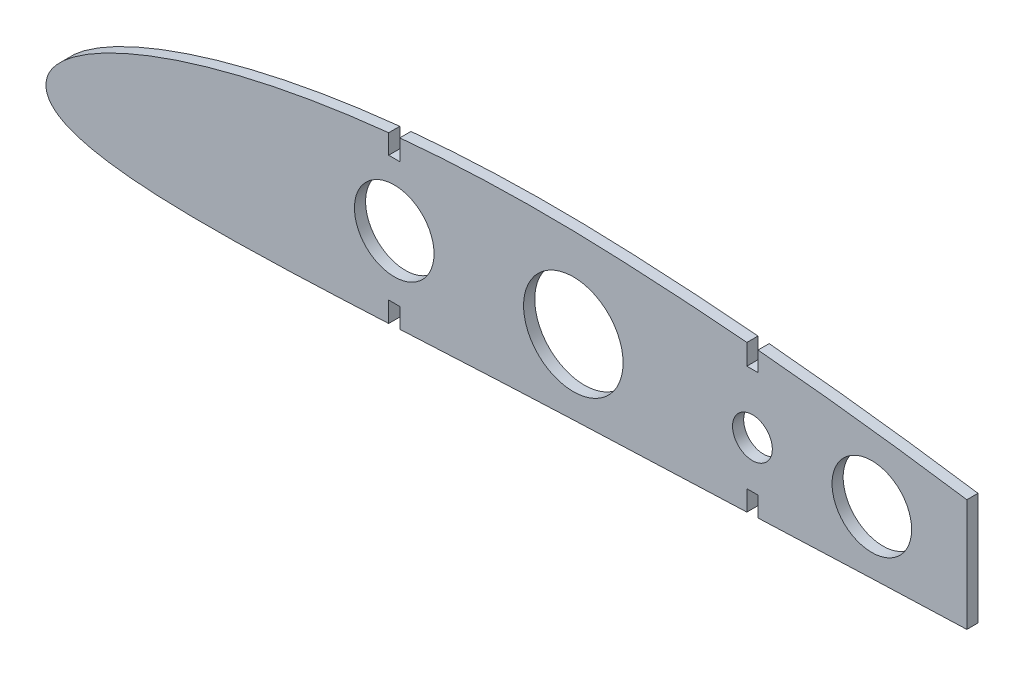
ISO-10303-21;
HEADER;
FILE_DESCRIPTION(('STEP AP214'),'2;1');
FILE_NAME('part.step','',(''),(''),'','','');
FILE_SCHEMA(('AUTOMOTIVE_DESIGN { 1 0 10303 214 1 1 1 1 }'));
ENDSEC;
DATA;
#1=APPLICATION_CONTEXT('core data for automotive mechanical design processes');
#2=APPLICATION_PROTOCOL_DEFINITION('international standard','automotive_design',2000,#1);
#3=PRODUCT_CONTEXT('',#1,'mechanical');
#4=PRODUCT('Part','Part','',(#3));
#5=PRODUCT_RELATED_PRODUCT_CATEGORY('part','',(#4));
#6=PRODUCT_DEFINITION_FORMATION('','',#4);
#7=PRODUCT_DEFINITION_CONTEXT('part definition',#1,'design');
#8=PRODUCT_DEFINITION('design','',#6,#7);
#9=PRODUCT_DEFINITION_SHAPE('','',#8);
#10=(LENGTH_UNIT() NAMED_UNIT(*) SI_UNIT(.MILLI.,.METRE.));
#11=(NAMED_UNIT(*) PLANE_ANGLE_UNIT() SI_UNIT($,.RADIAN.));
#12=(NAMED_UNIT(*) SI_UNIT($,.STERADIAN.) SOLID_ANGLE_UNIT());
#13=UNCERTAINTY_MEASURE_WITH_UNIT(LENGTH_MEASURE(1.E-05),#10,'distance_accuracy_value','');
#14=(GEOMETRIC_REPRESENTATION_CONTEXT(3) GLOBAL_UNCERTAINTY_ASSIGNED_CONTEXT((#13)) GLOBAL_UNIT_ASSIGNED_CONTEXT((#10,
#11,#12)) REPRESENTATION_CONTEXT('',''));
#15=CARTESIAN_POINT('',(0.,0.,0.));
#16=DIRECTION('',(0.,0.,1.));
#17=DIRECTION('',(1.,0.,0.));
#18=AXIS2_PLACEMENT_3D('',#15,#16,#17);
#19=CARTESIAN_POINT('',(39.6973889370821,23.944414653697,1.4));
#20=DIRECTION('',(0.,0.,-1.));
#21=DIRECTION('',(-1.,0.,0.));
#22=AXIS2_PLACEMENT_3D('',#19,#20,#21);
#23=PLANE('',#22);
#24=CARTESIAN_POINT('',(86.1,32.6822836326879,1.4));
#25=CARTESIAN_POINT('',(84.2510346578938,32.4889993263906,1.4));
#26=CARTESIAN_POINT('',(79.618112888192,31.9650030765368,1.4));
#27=CARTESIAN_POINT('',(72.2480677637087,30.9666917302447,1.4));
#28=CARTESIAN_POINT('',(64.0421604360207,29.6191902049138,1.4));
#29=CARTESIAN_POINT('',(55.9942006318401,28.0495199453062,1.4));
#30=CARTESIAN_POINT('',(48.1570877793211,26.2588427278324,1.4));
#31=CARTESIAN_POINT('',(40.6145349449317,24.258661850582,1.4));
#32=CARTESIAN_POINT('',(33.4961177715494,22.0806108900788,1.4));
#33=CARTESIAN_POINT('',(26.978950375824,19.7879772075339,1.4));
#34=CARTESIAN_POINT('',(21.2507377478071,17.4766696125604,1.4));
#35=CARTESIAN_POINT('',(16.4366661061337,15.2538553927234,1.4));
#36=CARTESIAN_POINT('',(12.5431206165653,13.2014083114473,1.4));
#37=CARTESIAN_POINT('',(9.46524765214313,11.3520444791679,1.4));
#38=CARTESIAN_POINT('',(7.04719364729386,9.69449327665322,1.4));
#39=CARTESIAN_POINT('',(5.14037290680512,8.19592153004412,1.4));
#40=CARTESIAN_POINT('',(3.62894157247065,6.81982751608439,1.4));
#41=CARTESIAN_POINT('',(2.4334459359028,5.5336340406067,1.4));
#42=CARTESIAN_POINT('',(1.49781916174154,4.31332492267934,1.4));
#43=CARTESIAN_POINT('',(0.800303574533793,3.13827094317873,1.4));
#44=CARTESIAN_POINT('',(0.302083458359672,2.00309955580692,1.4));
#45=CARTESIAN_POINT('',(0.143157814170765,1.23653837230996,1.4));
#46=CARTESIAN_POINT('',(0.067164999999314,0.869994999993723,1.4));
#47=B_SPLINE_CURVE_WITH_KNOTS('',3,(#24,#25,#26,#27,#28,#29,#30,#31,#32,#33,#34,#35,#36,#37,#38,
#39,#40,#41,#42,#43,#44,#45,#46),.UNSPECIFIED.,.F.,.F.,(4,1,1,1,1,1,1,1,1,1,1,1,1,1,1,1,1,1,1,1,
4),(0.738563450559912,0.753983199646257,0.777234690063445,0.800246382303428,0.822950708941546,
0.845237155368769,0.866915895838024,0.887662334604257,0.906968280539555,0.924203157053238,
0.938878974509372,0.95093161065299,0.960693484285195,0.968646729467272,0.975232933115936,
0.980794743901537,0.985583761312909,0.989781538836832,0.99352131251264,0.996902112954681,1.),.UNSPECIFIED.);
#48=CARTESIAN_POINT('',(86.1,32.6822836326879,1.4));
#49=VERTEX_POINT('',#48);
#50=CARTESIAN_POINT('',(0.0671649999993007,0.869994999993724,1.4));
#51=VERTEX_POINT('',#50);
#52=EDGE_CURVE('E265',#49,#51,#47,.T.);
#53=ORIENTED_EDGE('',*,*,#52,.T.);
#54=CARTESIAN_POINT('',(0.0671649999993007,0.869994999993724,1.4));
#55=CARTESIAN_POINT('',(0.0317993484582256,0.522886119865603,1.4));
#56=CARTESIAN_POINT('',(-0.038949104609303,-0.171499965077434,1.4));
#57=CARTESIAN_POINT('',(0.109187697364583,-1.23820842623752,1.4));
#58=CARTESIAN_POINT('',(0.489573910673218,-2.2943732985418,1.4));
#59=CARTESIAN_POINT('',(1.14006358920745,-3.31109649298061,1.4));
#60=CARTESIAN_POINT('',(2.04887309259207,-4.25498534250949,1.4));
#61=CARTESIAN_POINT('',(3.20736222336919,-5.12539925749088,1.4));
#62=CARTESIAN_POINT('',(4.62830025043884,-5.93009146946385,1.4));
#63=CARTESIAN_POINT('',(6.34935786687783,-6.68314380103964,1.4));
#64=CARTESIAN_POINT('',(8.44164396364156,-7.39506903042698,1.4));
#65=CARTESIAN_POINT('',(11.0165737014119,-8.07144334703238,1.4));
#66=CARTESIAN_POINT('',(14.2363639486186,-8.71040323003218,1.4));
#67=CARTESIAN_POINT('',(18.305613464467,-9.29546622360924,1.4));
#68=CARTESIAN_POINT('',(23.4193615077466,-9.79013943267865,1.4));
#69=CARTESIAN_POINT('',(29.6659329345063,-10.1462832025011,1.4));
#70=CARTESIAN_POINT('',(36.9599781818701,-10.3272943884671,1.4));
#71=CARTESIAN_POINT('',(45.0763579895263,-10.3267596782273,1.4));
#72=CARTESIAN_POINT('',(53.7569294627008,-10.1660112116384,1.4));
#73=CARTESIAN_POINT('',(62.8006704751775,-9.87929790134056,1.4));
#74=CARTESIAN_POINT('',(72.0811603346167,-9.50103494456721,1.4));
#75=CARTESIAN_POINT('',(79.8719296741359,-9.13817206209167,1.4));
#76=CARTESIAN_POINT('',(84.5620060592813,-8.90865553539452,1.4));
#77=CARTESIAN_POINT('',(86.1,-8.83257968507005,1.4));
#78=B_SPLINE_CURVE_WITH_KNOTS('',3,(#54,#55,#56,#57,#58,#59,#60,#61,#62,#63,#64,#65,#66,#67,#68,
#69,#70,#71,#72,#73,#74,#75,#76,#77),.UNSPECIFIED.,.F.,.F.,(4,1,1,1,1,1,1,1,1,1,1,1,1,1,1,1,1,1,
1,1,1,4),(0.,0.0029414462971684,0.00588431899986843,0.00901612990907169,0.0123645467308032,
0.0160079338878462,0.0200368451305784,0.0245737277973679,0.029783834741521,0.0358970100073663,
0.043240439578336,0.0522759653413005,0.0636345893302708,0.0779831757705631,0.0956981612833506,
0.116520086015495,0.139660730330278,0.164312170171254,0.189918890388144,0.216157201054431,
0.242837761985605,0.255856498153076),.UNSPECIFIED.);
#79=CARTESIAN_POINT('',(86.1,-8.83257968507005,1.4));
#80=VERTEX_POINT('',#79);
#81=EDGE_CURVE('E128',#51,#80,#78,.T.);
#82=ORIENTED_EDGE('',*,*,#81,.T.);
#83=DIRECTION('',(-2.66177293088671E-13,1.,0.));
#84=VECTOR('',#83,1.);
#85=CARTESIAN_POINT('',(86.1,-8.83257968507005,1.4));
#86=LINE('',#85,#84);
#87=CARTESIAN_POINT('',(86.0999999999986,-3.72311602878155,1.4));
#88=VERTEX_POINT('',#87);
#89=EDGE_CURVE('E313',#80,#88,#86,.T.);
#90=ORIENTED_EDGE('',*,*,#89,.T.);
#91=DIRECTION('',(1.,0.,0.));
#92=VECTOR('',#91,1.);
#93=CARTESIAN_POINT('',(86.0999999999986,-3.72311602878155,1.4));
#94=LINE('',#93,#92);
#95=CARTESIAN_POINT('',(88.8999999999986,-3.72311602878155,1.4));
#96=VERTEX_POINT('',#95);
#97=EDGE_CURVE('E332',#88,#96,#94,.T.);
#98=ORIENTED_EDGE('',*,*,#97,.T.);
#99=DIRECTION('',(2.68053724450879E-13,-1.,0.));
#100=VECTOR('',#99,1.);
#101=CARTESIAN_POINT('',(88.9,-8.69326756194679,1.4));
#102=LINE('',#101,#100);
#103=CARTESIAN_POINT('',(88.9,-8.69326756194679,1.4));
#104=VERTEX_POINT('',#103);
#105=EDGE_CURVE('E329',#96,#104,#102,.T.);
#106=ORIENTED_EDGE('',*,*,#105,.T.);
#107=CARTESIAN_POINT('',(88.9,-8.69326756194679,1.4));
#108=CARTESIAN_POINT('',(89.6178440409206,-8.65736526418831,1.4));
#109=CARTESIAN_POINT('',(93.5440996893992,-8.46030430018705,1.4));
#110=CARTESIAN_POINT('',(100.675081792889,-8.09760724639904,1.4));
#111=CARTESIAN_POINT('',(110.279925806631,-7.6155526338493,1.4));
#112=CARTESIAN_POINT('',(119.854698053668,-7.15533175215315,1.4));
#113=CARTESIAN_POINT('',(129.404950625834,-6.7269346543703,1.4));
#114=CARTESIAN_POINT('',(138.957043666083,-6.34477431491121,1.4));
#115=CARTESIAN_POINT('',(148.536329766784,-5.98958453726692,1.4));
#116=CARTESIAN_POINT('',(158.156896352257,-5.60432589403349,1.4));
#117=CARTESIAN_POINT('',(167.348797604893,-5.23117613113889,1.4));
#118=CARTESIAN_POINT('',(173.335752744361,-4.98602810177,1.4));
#119=CARTESIAN_POINT('',(176.1,-4.87302094787438,1.4));
#120=B_SPLINE_CURVE_WITH_KNOTS('',3,(#107,#108,#109,#110,#111,#112,#113,#114,#115,#116,#117,
#118,#119),.UNSPECIFIED.,.F.,.F.,(4,1,1,1,1,1,1,1,1,1,4),(0.263757045995791,0.269833582781319,
0.296993021546457,0.324123271890544,0.351139106824528,0.378035508721976,0.404946015910257,
0.431960836658272,0.459078394602815,0.486347400324305,0.509737016764113),.UNSPECIFIED.);
#121=CARTESIAN_POINT('',(176.1,-4.87302094787438,1.4));
#122=VERTEX_POINT('',#121);
#123=EDGE_CURVE('E331',#104,#122,#120,.T.);
#124=ORIENTED_EDGE('',*,*,#123,.T.);
#125=DIRECTION('',(0.,1.,0.));
#126=VECTOR('',#125,1.);
#127=CARTESIAN_POINT('',(176.1,-4.87302094787438,1.4));
#128=LINE('',#127,#126);
#129=CARTESIAN_POINT('',(176.1,0.224194977086704,1.4));
#130=VERTEX_POINT('',#129);
#131=EDGE_CURVE('E334',#122,#130,#128,.T.);
#132=ORIENTED_EDGE('',*,*,#131,.T.);
#133=DIRECTION('',(1.,0.,0.));
#134=VECTOR('',#133,1.);
#135=CARTESIAN_POINT('',(176.1,0.224194977086704,1.4));
#136=LINE('',#135,#134);
#137=CARTESIAN_POINT('',(178.9,0.224194977086704,1.4));
#138=VERTEX_POINT('',#137);
#139=EDGE_CURVE('E425',#130,#138,#136,.T.);
#140=ORIENTED_EDGE('',*,*,#139,.T.);
#141=DIRECTION('',(0.,-1.,0.));
#142=VECTOR('',#141,1.);
#143=CARTESIAN_POINT('',(178.9,-4.75863727345846,1.4));
#144=LINE('',#143,#142);
#145=CARTESIAN_POINT('',(178.9,-4.75863727345846,1.4));
#146=VERTEX_POINT('',#145);
#147=EDGE_CURVE('E420',#138,#146,#144,.T.);
#148=ORIENTED_EDGE('',*,*,#147,.T.);
#149=CARTESIAN_POINT('',(178.9,-4.75863727345846,1.4));
#150=CARTESIAN_POINT('',(181.65297931697,-4.64627860575326,1.4));
#151=CARTESIAN_POINT('',(187.626173611282,-4.40327373861616,1.4));
#152=CARTESIAN_POINT('',(196.814618569952,-4.0353330086338,1.4));
#153=CARTESIAN_POINT('',(206.460819266289,-3.65949214165038,1.4));
#154=CARTESIAN_POINT('',(216.093643374917,-3.29787698086627,1.4));
#155=CARTESIAN_POINT('',(224.397462901539,-3.00033069911463,1.4));
#156=CARTESIAN_POINT('',(229.490633691348,-2.82565856207694,1.4));
#157=CARTESIAN_POINT('',(231.376774992692,-2.7621087327024,1.4));
#158=B_SPLINE_CURVE_WITH_KNOTS('',3,(#149,#150,#151,#152,#153,#154,#155,#156,#157),
.UNSPECIFIED.,.F.,.F.,(4,1,1,1,1,1,4),(0.517634386173075,0.540928594677757,0.568176028038828,
0.595379568955062,0.622543444942076,0.6496732603013,0.665628529321904),.UNSPECIFIED.);
#159=CARTESIAN_POINT('',(231.376774992692,-2.7621087327024,1.4));
#160=VERTEX_POINT('',#159);
#161=EDGE_CURVE('E416',#146,#160,#158,.T.);
#162=ORIENTED_EDGE('',*,*,#161,.T.);
#163=DIRECTION('',(0.,1.,0.));
#164=VECTOR('',#163,1.);
#165=CARTESIAN_POINT('',(231.376774992692,25.4606830809636,1.4));
#166=LINE('',#165,#164);
#167=CARTESIAN_POINT('',(231.376774992692,25.4606830809636,1.4));
#168=VERTEX_POINT('',#167);
#169=EDGE_CURVE('E407',#160,#168,#166,.T.);
#170=ORIENTED_EDGE('',*,*,#169,.T.);
#171=CARTESIAN_POINT('',(231.376774992692,25.4606830809611,1.4));
#172=CARTESIAN_POINT('',(228.623090859002,25.8729767046744,1.4));
#173=CARTESIAN_POINT('',(222.8161861498,26.717098434741,1.4));
#174=CARTESIAN_POINT('',(213.950527179165,27.9228398445289,1.4));
#175=CARTESIAN_POINT('',(204.785615161902,29.076995056434,1.4));
#176=CARTESIAN_POINT('',(195.623903707794,30.1359465590156,1.4));
#177=CARTESIAN_POINT('',(186.996472649977,31.0414022958925,1.4));
#178=CARTESIAN_POINT('',(181.421156727263,31.5704511894189,1.4));
#179=CARTESIAN_POINT('',(178.9,31.7978561266087,1.4));
#180=B_SPLINE_CURVE_WITH_KNOTS('',3,(#171,#172,#173,#174,#175,#176,#177,#178,#179),
.UNSPECIFIED.,.F.,.F.,(4,1,1,1,1,1,4),(0.335389042184353,0.358484538095463,0.384061185999046,
0.409602822472883,0.435103874040523,0.460559416336008,0.481556447154997),.UNSPECIFIED.);
#181=CARTESIAN_POINT('',(178.9,31.7978561266087,1.4));
#182=VERTEX_POINT('',#181);
#183=EDGE_CURVE('E402',#168,#182,#180,.T.);
#184=ORIENTED_EDGE('',*,*,#183,.T.);
#185=DIRECTION('',(0.,-1.,0.));
#186=VECTOR('',#185,1.);
#187=CARTESIAN_POINT('',(178.9,26.8829164511471,1.4));
#188=LINE('',#187,#186);
#189=CARTESIAN_POINT('',(178.9,26.8829164511471,1.4));
#190=VERTEX_POINT('',#189);
#191=EDGE_CURVE('E398',#182,#190,#188,.T.);
#192=ORIENTED_EDGE('',*,*,#191,.T.);
#193=DIRECTION('',(-1.,0.,0.));
#194=VECTOR('',#193,1.);
#195=CARTESIAN_POINT('',(176.1,26.8829164511471,1.4));
#196=LINE('',#195,#194);
#197=CARTESIAN_POINT('',(176.1,26.8829164511471,1.4));
#198=VERTEX_POINT('',#197);
#199=EDGE_CURVE('E389',#190,#198,#196,.T.);
#200=ORIENTED_EDGE('',*,*,#199,.T.);
#201=DIRECTION('',(0.,1.,0.));
#202=VECTOR('',#201,1.);
#203=CARTESIAN_POINT('',(176.1,26.8829164511471,1.4));
#204=LINE('',#203,#202);
#205=CARTESIAN_POINT('',(176.1,32.0455325149207,1.4));
#206=VERTEX_POINT('',#205);
#207=EDGE_CURVE('E384',#198,#206,#204,.T.);
#208=ORIENTED_EDGE('',*,*,#207,.T.);
#209=CARTESIAN_POINT('',(176.1,32.0455325149207,1.4));
#210=CARTESIAN_POINT('',(173.460642447566,32.274383054284,1.4));
#211=CARTESIAN_POINT('',(167.786299658765,32.7382446023725,1.4));
#212=CARTESIAN_POINT('',(159.079993996246,33.3545483352841,1.4));
#213=CARTESIAN_POINT('',(150.01382485137,33.8803397022619,1.4));
#214=CARTESIAN_POINT('',(141.03753396858,34.2977593747544,1.4));
#215=CARTESIAN_POINT('',(132.176453798979,34.5613097262379,1.4));
#216=CARTESIAN_POINT('',(123.418285188149,34.6361339506441,1.4));
#217=CARTESIAN_POINT('',(114.728660275559,34.5223888312043,1.4));
#218=CARTESIAN_POINT('',(106.092728826747,34.2174193518532,1.4));
#219=CARTESIAN_POINT('',(97.4854148877134,33.7128946320586,1.4));
#220=CARTESIAN_POINT('',(91.7635690369753,33.2378378213834,1.4));
#221=CARTESIAN_POINT('',(88.9,32.9629736814773,1.4));
#222=B_SPLINE_CURVE_WITH_KNOTS('',3,(#209,#210,#211,#212,#213,#214,#215,#216,#217,#218,#219,
#220,#221),.UNSPECIFIED.,.F.,.F.,(4,1,1,1,1,1,1,1,1,1,4),(0.489328360496948,0.511303069995141,
0.53655151535457,0.561723365940153,0.586628866723787,0.611085431247163,0.63525120042125,
0.659272175841394,0.683163753229342,0.706922144180534,0.730783121093174),.UNSPECIFIED.);
#223=CARTESIAN_POINT('',(88.9,32.9629736814773,1.4));
#224=VERTEX_POINT('',#223);
#225=EDGE_CURVE('E180',#206,#224,#222,.T.);
#226=ORIENTED_EDGE('',*,*,#225,.T.);
#227=DIRECTION('',(0.,-1.,0.));
#228=VECTOR('',#227,1.);
#229=CARTESIAN_POINT('',(88.9,32.9629736814773,1.4));
#230=LINE('',#229,#228);
#231=CARTESIAN_POINT('',(88.9,27.7856210959932,1.4));
#232=VERTEX_POINT('',#231);
#233=EDGE_CURVE('E174',#224,#232,#230,.T.);
#234=ORIENTED_EDGE('',*,*,#233,.T.);
#235=DIRECTION('',(-1.,0.,0.));
#236=VECTOR('',#235,1.);
#237=CARTESIAN_POINT('',(86.1,27.7856210959932,1.4));
#238=LINE('',#237,#236);
#239=CARTESIAN_POINT('',(86.1,27.7856210959932,1.4));
#240=VERTEX_POINT('',#239);
#241=EDGE_CURVE('E178',#232,#240,#238,.T.);
#242=ORIENTED_EDGE('',*,*,#241,.T.);
#243=DIRECTION('',(0.,1.,0.));
#244=VECTOR('',#243,1.);
#245=CARTESIAN_POINT('',(86.1,32.6822836326879,1.4));
#246=LINE('',#245,#244);
#247=EDGE_CURVE('E52',#240,#49,#246,.T.);
#248=ORIENTED_EDGE('',*,*,#247,.T.);
#249=EDGE_LOOP('',(#53,#82,#90,#98,#106,#124,#132,#140,#148,#162,#170,#184,#192,#200,#208,#226,
#234,#242,#248));
#250=FACE_BOUND('',#249,.T.);
#251=CARTESIAN_POINT('',(87.5,12.0312525336058,1.4));
#252=DIRECTION('',(0.,0.,1.));
#253=DIRECTION('',(1.,0.,0.));
#254=AXIS2_PLACEMENT_3D('',#251,#252,#253);
#255=CIRCLE('',#254,10.0000000000008);
#256=CARTESIAN_POINT('',(97.5000000000008,12.0312525336058,1.4));
#257=VERTEX_POINT('',#256);
#258=EDGE_CURVE('E204',#257,#257,#255,.T.);
#259=ORIENTED_EDGE('',*,*,#258,.F.);
#260=EDGE_LOOP('',(#259));
#261=FACE_BOUND('',#260,.T.);
#262=CARTESIAN_POINT('',(177.5,12.0312525336058,1.4));
#263=DIRECTION('',(0.,0.,1.));
#264=DIRECTION('',(1.,0.,0.));
#265=AXIS2_PLACEMENT_3D('',#262,#263,#264);
#266=CIRCLE('',#265,5.00000000000075);
#267=CARTESIAN_POINT('',(182.500000000001,12.0312525336058,1.4));
#268=VERTEX_POINT('',#267);
#269=EDGE_CURVE('E671',#268,#268,#266,.T.);
#270=ORIENTED_EDGE('',*,*,#269,.F.);
#271=EDGE_LOOP('',(#270));
#272=FACE_BOUND('',#271,.T.);
#273=CARTESIAN_POINT('',(132.5,12.0312525336058,1.4));
#274=DIRECTION('',(0.,0.,1.));
#275=DIRECTION('',(1.,0.,0.));
#276=AXIS2_PLACEMENT_3D('',#273,#274,#275);
#277=CIRCLE('',#276,12.5000000000008);
#278=CARTESIAN_POINT('',(145.000000000001,12.0312525336058,1.4));
#279=VERTEX_POINT('',#278);
#280=EDGE_CURVE('E665',#279,#279,#277,.T.);
#281=ORIENTED_EDGE('',*,*,#280,.F.);
#282=EDGE_LOOP('',(#281));
#283=FACE_BOUND('',#282,.T.);
#284=CARTESIAN_POINT('',(207.5,12.0312525336058,1.4));
#285=DIRECTION('',(0.,0.,1.));
#286=DIRECTION('',(1.,0.,0.));
#287=AXIS2_PLACEMENT_3D('',#284,#285,#286);
#288=CIRCLE('',#287,10.);
#289=CARTESIAN_POINT('',(217.5,12.0312525336058,1.4));
#290=VERTEX_POINT('',#289);
#291=EDGE_CURVE('E656',#290,#290,#288,.T.);
#292=ORIENTED_EDGE('',*,*,#291,.F.);
#293=EDGE_LOOP('',(#292));
#294=FACE_BOUND('',#293,.T.);
#295=ADVANCED_FACE('F34',(#250,#261,#272,#283,#294),#23,.F.);
#296=CARTESIAN_POINT('',(39.6973889370821,23.944414653697,-1.4));
#297=DIRECTION('',(0.,0.,-1.));
#298=DIRECTION('',(-1.,0.,0.));
#299=AXIS2_PLACEMENT_3D('',#296,#297,#298);
#300=PLANE('',#299);
#301=CARTESIAN_POINT('',(132.5,12.0312525336058,-1.4));
#302=DIRECTION('',(0.,0.,1.));
#303=DIRECTION('',(1.,0.,0.));
#304=AXIS2_PLACEMENT_3D('',#301,#302,#303);
#305=CIRCLE('',#304,12.5000000000008);
#306=CARTESIAN_POINT('',(145.000000000001,12.0312525336058,-1.4));
#307=VERTEX_POINT('',#306);
#308=EDGE_CURVE('E662',#307,#307,#305,.T.);
#309=ORIENTED_EDGE('',*,*,#308,.T.);
#310=EDGE_LOOP('',(#309));
#311=FACE_BOUND('',#310,.T.);
#312=CARTESIAN_POINT('',(87.5,12.0312525336058,-1.4));
#313=DIRECTION('',(0.,0.,1.));
#314=DIRECTION('',(1.,0.,0.));
#315=AXIS2_PLACEMENT_3D('',#312,#313,#314);
#316=CIRCLE('',#315,10.0000000000008);
#317=CARTESIAN_POINT('',(97.5000000000008,12.0312525336058,-1.4));
#318=VERTEX_POINT('',#317);
#319=EDGE_CURVE('E674',#318,#318,#316,.T.);
#320=ORIENTED_EDGE('',*,*,#319,.T.);
#321=EDGE_LOOP('',(#320));
#322=FACE_BOUND('',#321,.T.);
#323=CARTESIAN_POINT('',(86.1,32.6822836326879,-1.4));
#324=CARTESIAN_POINT('',(84.2510346578938,32.4889993263906,-1.4));
#325=CARTESIAN_POINT('',(79.618112888192,31.9650030765368,-1.4));
#326=CARTESIAN_POINT('',(72.2480677637087,30.9666917302447,-1.4));
#327=CARTESIAN_POINT('',(64.0421604360207,29.6191902049138,-1.4));
#328=CARTESIAN_POINT('',(55.9942006318401,28.0495199453062,-1.4));
#329=CARTESIAN_POINT('',(48.1570877793211,26.2588427278324,-1.4));
#330=CARTESIAN_POINT('',(40.6145349449317,24.258661850582,-1.4));
#331=CARTESIAN_POINT('',(33.4961177715494,22.0806108900788,-1.4));
#332=CARTESIAN_POINT('',(26.978950375824,19.7879772075339,-1.4));
#333=CARTESIAN_POINT('',(21.2507377478071,17.4766696125604,-1.4));
#334=CARTESIAN_POINT('',(16.4366661061337,15.2538553927234,-1.4));
#335=CARTESIAN_POINT('',(12.5431206165653,13.2014083114473,-1.4));
#336=CARTESIAN_POINT('',(9.46524765214313,11.3520444791679,-1.4));
#337=CARTESIAN_POINT('',(7.04719364729386,9.69449327665322,-1.4));
#338=CARTESIAN_POINT('',(5.14037290680512,8.19592153004412,-1.4));
#339=CARTESIAN_POINT('',(3.62894157247065,6.81982751608439,-1.4));
#340=CARTESIAN_POINT('',(2.4334459359028,5.5336340406067,-1.4));
#341=CARTESIAN_POINT('',(1.49781916174154,4.31332492267934,-1.4));
#342=CARTESIAN_POINT('',(0.800303574533793,3.13827094317873,-1.4));
#343=CARTESIAN_POINT('',(0.302083458359672,2.00309955580692,-1.4));
#344=CARTESIAN_POINT('',(0.143157814170765,1.23653837230996,-1.4));
#345=CARTESIAN_POINT('',(0.067164999999314,0.869994999993723,-1.4));
#346=B_SPLINE_CURVE_WITH_KNOTS('',3,(#323,#324,#325,#326,#327,#328,#329,#330,#331,#332,#333,
#334,#335,#336,#337,#338,#339,#340,#341,#342,#343,#344,#345),.UNSPECIFIED.,.F.,.F.,(4,1,1,1,1,1,
1,1,1,1,1,1,1,1,1,1,1,1,1,1,4),(0.738563450559912,0.753983199646257,0.777234690063445,
0.800246382303428,0.822950708941546,0.845237155368769,0.866915895838024,0.887662334604257,
0.906968280539555,0.924203157053238,0.938878974509372,0.95093161065299,0.960693484285195,
0.968646729467272,0.975232933115936,0.980794743901537,0.985583761312909,0.989781538836832,
0.99352131251264,0.996902112954681,1.),.UNSPECIFIED.);
#347=CARTESIAN_POINT('',(86.1,32.6822836326879,-1.4));
#348=VERTEX_POINT('',#347);
#349=CARTESIAN_POINT('',(0.0671649999993007,0.869994999993724,-1.4));
#350=VERTEX_POINT('',#349);
#351=EDGE_CURVE('E198',#348,#350,#346,.T.);
#352=ORIENTED_EDGE('',*,*,#351,.F.);
#353=DIRECTION('',(0.,1.,0.));
#354=VECTOR('',#353,1.);
#355=CARTESIAN_POINT('',(86.1,32.6822836326879,-1.4));
#356=LINE('',#355,#354);
#357=CARTESIAN_POINT('',(86.1,27.7856210959932,-1.4));
#358=VERTEX_POINT('',#357);
#359=EDGE_CURVE('E120',#358,#348,#356,.T.);
#360=ORIENTED_EDGE('',*,*,#359,.F.);
#361=DIRECTION('',(-1.,0.,0.));
#362=VECTOR('',#361,1.);
#363=CARTESIAN_POINT('',(86.1,27.7856210959932,-1.4));
#364=LINE('',#363,#362);
#365=CARTESIAN_POINT('',(88.9,27.7856210959932,-1.4));
#366=VERTEX_POINT('',#365);
#367=EDGE_CURVE('E114',#366,#358,#364,.T.);
#368=ORIENTED_EDGE('',*,*,#367,.F.);
#369=DIRECTION('',(0.,-1.,0.));
#370=VECTOR('',#369,1.);
#371=CARTESIAN_POINT('',(88.9,32.9629736814773,-1.4));
#372=LINE('',#371,#370);
#373=CARTESIAN_POINT('',(88.9,32.9629736814773,-1.4));
#374=VERTEX_POINT('',#373);
#375=EDGE_CURVE('E188',#374,#366,#372,.T.);
#376=ORIENTED_EDGE('',*,*,#375,.F.);
#377=CARTESIAN_POINT('',(176.1,32.0455325149207,-1.4));
#378=CARTESIAN_POINT('',(173.460642447566,32.274383054284,-1.4));
#379=CARTESIAN_POINT('',(167.786299658765,32.7382446023725,-1.4));
#380=CARTESIAN_POINT('',(159.079993996246,33.3545483352841,-1.4));
#381=CARTESIAN_POINT('',(150.01382485137,33.8803397022619,-1.4));
#382=CARTESIAN_POINT('',(141.03753396858,34.2977593747544,-1.4));
#383=CARTESIAN_POINT('',(132.176453798979,34.5613097262379,-1.4));
#384=CARTESIAN_POINT('',(123.418285188149,34.6361339506441,-1.4));
#385=CARTESIAN_POINT('',(114.728660275559,34.5223888312043,-1.4));
#386=CARTESIAN_POINT('',(106.092728826747,34.2174193518532,-1.4));
#387=CARTESIAN_POINT('',(97.4854148877134,33.7128946320586,-1.4));
#388=CARTESIAN_POINT('',(91.7635690369753,33.2378378213834,-1.4));
#389=CARTESIAN_POINT('',(88.9,32.9629736814773,-1.4));
#390=B_SPLINE_CURVE_WITH_KNOTS('',3,(#377,#378,#379,#380,#381,#382,#383,#384,#385,#386,#387,
#388,#389),.UNSPECIFIED.,.F.,.F.,(4,1,1,1,1,1,1,1,1,1,4),(0.489328360496948,0.511303069995141,
0.53655151535457,0.561723365940153,0.586628866723787,0.611085431247163,0.63525120042125,
0.659272175841394,0.683163753229342,0.706922144180534,0.730783121093174),.UNSPECIFIED.);
#391=CARTESIAN_POINT('',(176.1,32.0455325149207,-1.4));
#392=VERTEX_POINT('',#391);
#393=EDGE_CURVE('E255',#392,#374,#390,.T.);
#394=ORIENTED_EDGE('',*,*,#393,.F.);
#395=DIRECTION('',(0.,1.,0.));
#396=VECTOR('',#395,1.);
#397=CARTESIAN_POINT('',(176.1,26.8829164511471,-1.4));
#398=LINE('',#397,#396);
#399=CARTESIAN_POINT('',(176.1,26.8829164511471,-1.4));
#400=VERTEX_POINT('',#399);
#401=EDGE_CURVE('E253',#400,#392,#398,.T.);
#402=ORIENTED_EDGE('',*,*,#401,.F.);
#403=DIRECTION('',(-1.,0.,0.));
#404=VECTOR('',#403,1.);
#405=CARTESIAN_POINT('',(176.1,26.8829164511471,-1.4));
#406=LINE('',#405,#404);
#407=CARTESIAN_POINT('',(178.9,26.8829164511471,-1.4));
#408=VERTEX_POINT('',#407);
#409=EDGE_CURVE('E251',#408,#400,#406,.T.);
#410=ORIENTED_EDGE('',*,*,#409,.F.);
#411=DIRECTION('',(0.,-1.,0.));
#412=VECTOR('',#411,1.);
#413=CARTESIAN_POINT('',(178.9,26.8829164511471,-1.4));
#414=LINE('',#413,#412);
#415=CARTESIAN_POINT('',(178.9,31.7978561266087,-1.4));
#416=VERTEX_POINT('',#415);
#417=EDGE_CURVE('E246',#416,#408,#414,.T.);
#418=ORIENTED_EDGE('',*,*,#417,.F.);
#419=CARTESIAN_POINT('',(231.376774992692,25.4606830809611,-1.4));
#420=CARTESIAN_POINT('',(228.623090859002,25.8729767046744,-1.4));
#421=CARTESIAN_POINT('',(222.8161861498,26.717098434741,-1.4));
#422=CARTESIAN_POINT('',(213.950527179165,27.9228398445289,-1.4));
#423=CARTESIAN_POINT('',(204.785615161902,29.076995056434,-1.4));
#424=CARTESIAN_POINT('',(195.623903707794,30.1359465590156,-1.4));
#425=CARTESIAN_POINT('',(186.996472649977,31.0414022958925,-1.4));
#426=CARTESIAN_POINT('',(181.421156727263,31.5704511894189,-1.4));
#427=CARTESIAN_POINT('',(178.9,31.7978561266087,-1.4));
#428=B_SPLINE_CURVE_WITH_KNOTS('',3,(#419,#420,#421,#422,#423,#424,#425,#426,#427),
.UNSPECIFIED.,.F.,.F.,(4,1,1,1,1,1,4),(0.335389042184353,0.358484538095463,0.384061185999046,
0.409602822472883,0.435103874040523,0.460559416336008,0.481556447154997),.UNSPECIFIED.);
#429=CARTESIAN_POINT('',(231.376774992692,25.4606830809636,-1.4));
#430=VERTEX_POINT('',#429);
#431=EDGE_CURVE('E242',#430,#416,#428,.T.);
#432=ORIENTED_EDGE('',*,*,#431,.F.);
#433=DIRECTION('',(0.,1.,0.));
#434=VECTOR('',#433,1.);
#435=CARTESIAN_POINT('',(231.376774992692,25.4606830809636,-1.4));
#436=LINE('',#435,#434);
#437=CARTESIAN_POINT('',(231.376774992692,-2.7621087327024,-1.4));
#438=VERTEX_POINT('',#437);
#439=EDGE_CURVE('E237',#438,#430,#436,.T.);
#440=ORIENTED_EDGE('',*,*,#439,.F.);
#441=CARTESIAN_POINT('',(178.9,-4.75863727345846,-1.4));
#442=CARTESIAN_POINT('',(181.65297931697,-4.64627860575326,-1.4));
#443=CARTESIAN_POINT('',(187.626173611282,-4.40327373861616,-1.4));
#444=CARTESIAN_POINT('',(196.814618569952,-4.0353330086338,-1.4));
#445=CARTESIAN_POINT('',(206.460819266289,-3.65949214165038,-1.4));
#446=CARTESIAN_POINT('',(216.093643374917,-3.29787698086627,-1.4));
#447=CARTESIAN_POINT('',(224.397462901539,-3.00033069911463,-1.4));
#448=CARTESIAN_POINT('',(229.490633691348,-2.82565856207694,-1.4));
#449=CARTESIAN_POINT('',(231.376774992692,-2.7621087327024,-1.4));
#450=B_SPLINE_CURVE_WITH_KNOTS('',3,(#441,#442,#443,#444,#445,#446,#447,#448,#449),
.UNSPECIFIED.,.F.,.F.,(4,1,1,1,1,1,4),(0.517634386173075,0.540928594677757,0.568176028038828,
0.595379568955062,0.622543444942076,0.6496732603013,0.665628529321904),.UNSPECIFIED.);
#451=CARTESIAN_POINT('',(178.9,-4.75863727345846,-1.4));
#452=VERTEX_POINT('',#451);
#453=EDGE_CURVE('E233',#452,#438,#450,.T.);
#454=ORIENTED_EDGE('',*,*,#453,.F.);
#455=DIRECTION('',(0.,-1.,0.));
#456=VECTOR('',#455,1.);
#457=CARTESIAN_POINT('',(178.9,-4.75863727345846,-1.4));
#458=LINE('',#457,#456);
#459=CARTESIAN_POINT('',(178.9,0.224194977086704,-1.4));
#460=VERTEX_POINT('',#459);
#461=EDGE_CURVE('E231',#460,#452,#458,.T.);
#462=ORIENTED_EDGE('',*,*,#461,.F.);
#463=DIRECTION('',(1.,0.,0.));
#464=VECTOR('',#463,1.);
#465=CARTESIAN_POINT('',(176.1,0.224194977086704,-1.4));
#466=LINE('',#465,#464);
#467=CARTESIAN_POINT('',(176.1,0.224194977086704,-1.4));
#468=VERTEX_POINT('',#467);
#469=EDGE_CURVE('E229',#468,#460,#466,.T.);
#470=ORIENTED_EDGE('',*,*,#469,.F.);
#471=DIRECTION('',(0.,1.,0.));
#472=VECTOR('',#471,1.);
#473=CARTESIAN_POINT('',(176.1,-4.87302094787438,-1.4));
#474=LINE('',#473,#472);
#475=CARTESIAN_POINT('',(176.1,-4.87302094787438,-1.4));
#476=VERTEX_POINT('',#475);
#477=EDGE_CURVE('E224',#476,#468,#474,.T.);
#478=ORIENTED_EDGE('',*,*,#477,.F.);
#479=CARTESIAN_POINT('',(88.9,-8.69326756194679,-1.4));
#480=CARTESIAN_POINT('',(89.6178440409206,-8.65736526418831,-1.4));
#481=CARTESIAN_POINT('',(93.5440996893992,-8.46030430018705,-1.4));
#482=CARTESIAN_POINT('',(100.675081792889,-8.09760724639904,-1.4));
#483=CARTESIAN_POINT('',(110.279925806631,-7.6155526338493,-1.4));
#484=CARTESIAN_POINT('',(119.854698053668,-7.15533175215315,-1.4));
#485=CARTESIAN_POINT('',(129.404950625834,-6.7269346543703,-1.4));
#486=CARTESIAN_POINT('',(138.957043666083,-6.34477431491121,-1.4));
#487=CARTESIAN_POINT('',(148.536329766784,-5.98958453726692,-1.4));
#488=CARTESIAN_POINT('',(158.156896352257,-5.60432589403349,-1.4));
#489=CARTESIAN_POINT('',(167.348797604893,-5.23117613113889,-1.4));
#490=CARTESIAN_POINT('',(173.335752744361,-4.98602810177,-1.4));
#491=CARTESIAN_POINT('',(176.1,-4.87302094787438,-1.4));
#492=B_SPLINE_CURVE_WITH_KNOTS('',3,(#479,#480,#481,#482,#483,#484,#485,#486,#487,#488,#489,
#490,#491),.UNSPECIFIED.,.F.,.F.,(4,1,1,1,1,1,1,1,1,1,4),(0.263757045995791,0.269833582781319,
0.296993021546457,0.324123271890544,0.351139106824528,0.378035508721976,0.404946015910257,
0.431960836658272,0.459078394602815,0.486347400324305,0.509737016764113),.UNSPECIFIED.);
#493=CARTESIAN_POINT('',(88.9,-8.69326756194679,-1.4));
#494=VERTEX_POINT('',#493);
#495=EDGE_CURVE('E220',#494,#476,#492,.T.);
#496=ORIENTED_EDGE('',*,*,#495,.F.);
#497=DIRECTION('',(2.68053724450879E-13,-1.,0.));
#498=VECTOR('',#497,1.);
#499=CARTESIAN_POINT('',(88.9,-8.69326756194679,-1.4));
#500=LINE('',#499,#498);
#501=CARTESIAN_POINT('',(88.8999999999986,-3.72311602878155,-1.4));
#502=VERTEX_POINT('',#501);
#503=EDGE_CURVE('E218',#502,#494,#500,.T.);
#504=ORIENTED_EDGE('',*,*,#503,.F.);
#505=DIRECTION('',(1.,0.,0.));
#506=VECTOR('',#505,1.);
#507=CARTESIAN_POINT('',(86.0999999999986,-3.72311602878155,-1.4));
#508=LINE('',#507,#506);
#509=CARTESIAN_POINT('',(86.0999999999986,-3.72311602878155,-1.4));
#510=VERTEX_POINT('',#509);
#511=EDGE_CURVE('E216',#510,#502,#508,.T.);
#512=ORIENTED_EDGE('',*,*,#511,.F.);
#513=DIRECTION('',(-2.66177293088671E-13,1.,0.));
#514=VECTOR('',#513,1.);
#515=CARTESIAN_POINT('',(86.1,-8.83257968507005,-1.4));
#516=LINE('',#515,#514);
#517=CARTESIAN_POINT('',(86.1,-8.83257968507005,-1.4));
#518=VERTEX_POINT('',#517);
#519=EDGE_CURVE('E211',#518,#510,#516,.T.);
#520=ORIENTED_EDGE('',*,*,#519,.F.);
#521=CARTESIAN_POINT('',(0.0671649999993007,0.869994999993724,-1.4));
#522=CARTESIAN_POINT('',(0.0317993484582256,0.522886119865603,-1.4));
#523=CARTESIAN_POINT('',(-0.038949104609303,-0.171499965077434,-1.4));
#524=CARTESIAN_POINT('',(0.109187697364583,-1.23820842623752,-1.4));
#525=CARTESIAN_POINT('',(0.489573910673218,-2.2943732985418,-1.4));
#526=CARTESIAN_POINT('',(1.14006358920745,-3.31109649298061,-1.4));
#527=CARTESIAN_POINT('',(2.04887309259207,-4.25498534250949,-1.4));
#528=CARTESIAN_POINT('',(3.20736222336919,-5.12539925749088,-1.4));
#529=CARTESIAN_POINT('',(4.62830025043884,-5.93009146946385,-1.4));
#530=CARTESIAN_POINT('',(6.34935786687783,-6.68314380103964,-1.4));
#531=CARTESIAN_POINT('',(8.44164396364156,-7.39506903042698,-1.4));
#532=CARTESIAN_POINT('',(11.0165737014119,-8.07144334703238,-1.4));
#533=CARTESIAN_POINT('',(14.2363639486186,-8.71040323003218,-1.4));
#534=CARTESIAN_POINT('',(18.305613464467,-9.29546622360924,-1.4));
#535=CARTESIAN_POINT('',(23.4193615077466,-9.79013943267865,-1.4));
#536=CARTESIAN_POINT('',(29.6659329345063,-10.1462832025011,-1.4));
#537=CARTESIAN_POINT('',(36.9599781818701,-10.3272943884671,-1.4));
#538=CARTESIAN_POINT('',(45.0763579895263,-10.3267596782273,-1.4));
#539=CARTESIAN_POINT('',(53.7569294627008,-10.1660112116384,-1.4));
#540=CARTESIAN_POINT('',(62.8006704751775,-9.87929790134056,-1.4));
#541=CARTESIAN_POINT('',(72.0811603346167,-9.50103494456721,-1.4));
#542=CARTESIAN_POINT('',(79.8719296741359,-9.13817206209167,-1.4));
#543=CARTESIAN_POINT('',(84.5620060592813,-8.90865553539452,-1.4));
#544=CARTESIAN_POINT('',(86.1,-8.83257968507005,-1.4));
#545=B_SPLINE_CURVE_WITH_KNOTS('',3,(#521,#522,#523,#524,#525,#526,#527,#528,#529,#530,#531,
#532,#533,#534,#535,#536,#537,#538,#539,#540,#541,#542,#543,#544),.UNSPECIFIED.,.F.,.F.,(4,1,1,
1,1,1,1,1,1,1,1,1,1,1,1,1,1,1,1,1,1,4),(0.,0.0029414462971684,0.00588431899986843,
0.00901612990907169,0.0123645467308032,0.0160079338878462,0.0200368451305784,0.0245737277973679,
0.029783834741521,0.0358970100073663,0.043240439578336,0.0522759653413005,0.0636345893302708,
0.0779831757705631,0.0956981612833506,0.116520086015495,0.139660730330278,0.164312170171254,
0.189918890388144,0.216157201054431,0.242837761985605,0.255856498153076),.UNSPECIFIED.);
#546=EDGE_CURVE('E203',#350,#518,#545,.T.);
#547=ORIENTED_EDGE('',*,*,#546,.F.);
#548=EDGE_LOOP('',(#352,#360,#368,#376,#394,#402,#410,#418,#432,#440,#454,#462,#470,#478,#496,
#504,#512,#520,#547));
#549=FACE_BOUND('',#548,.T.);
#550=CARTESIAN_POINT('',(177.5,12.0312525336058,-1.4));
#551=DIRECTION('',(0.,0.,1.));
#552=DIRECTION('',(1.,0.,0.));
#553=AXIS2_PLACEMENT_3D('',#550,#551,#552);
#554=CIRCLE('',#553,5.00000000000075);
#555=CARTESIAN_POINT('',(182.500000000001,12.0312525336058,-1.4));
#556=VERTEX_POINT('',#555);
#557=EDGE_CURVE('E668',#556,#556,#554,.T.);
#558=ORIENTED_EDGE('',*,*,#557,.T.);
#559=EDGE_LOOP('',(#558));
#560=FACE_BOUND('',#559,.T.);
#561=CARTESIAN_POINT('',(207.5,12.0312525336058,-1.4));
#562=DIRECTION('',(0.,0.,1.));
#563=DIRECTION('',(1.,0.,0.));
#564=AXIS2_PLACEMENT_3D('',#561,#562,#563);
#565=CIRCLE('',#564,10.);
#566=CARTESIAN_POINT('',(217.5,12.0312525336058,-1.4));
#567=VERTEX_POINT('',#566);
#568=EDGE_CURVE('E659',#567,#567,#565,.T.);
#569=ORIENTED_EDGE('',*,*,#568,.T.);
#570=EDGE_LOOP('',(#569));
#571=FACE_BOUND('',#570,.T.);
#572=ADVANCED_FACE('F317',(#311,#322,#549,#560,#571),#300,.T.);
#573=DIRECTION('',(0.,0.,-1.));
#574=VECTOR('',#573,1.);
#575=SURFACE_OF_LINEAR_EXTRUSION('',#47,#574);
#576=ORIENTED_EDGE('',*,*,#351,.T.);
#577=DIRECTION('',(0.,0.,-1.));
#578=VECTOR('',#577,1.);
#579=CARTESIAN_POINT('',(0.0671649999993007,0.869994999993724,1.4));
#580=LINE('',#579,#578);
#581=EDGE_CURVE('E11',#51,#350,#580,.T.);
#582=ORIENTED_EDGE('',*,*,#581,.F.);
#583=ORIENTED_EDGE('',*,*,#52,.F.);
#584=DIRECTION('',(0.,0.,-1.));
#585=VECTOR('',#584,1.);
#586=CARTESIAN_POINT('',(86.1,32.6822836326879,1.4));
#587=LINE('',#586,#585);
#588=EDGE_CURVE('E194',#49,#348,#587,.T.);
#589=ORIENTED_EDGE('',*,*,#588,.T.);
#590=EDGE_LOOP('',(#576,#582,#583,#589));
#591=FACE_BOUND('',#590,.T.);
#592=ADVANCED_FACE('F36',(#591),#575,.F.);
#593=DIRECTION('',(0.,0.,-1.));
#594=VECTOR('',#593,1.);
#595=SURFACE_OF_LINEAR_EXTRUSION('',#78,#594);
#596=ORIENTED_EDGE('',*,*,#546,.T.);
#597=DIRECTION('',(0.,0.,-1.));
#598=VECTOR('',#597,1.);
#599=CARTESIAN_POINT('',(86.1,-8.83257968507005,1.4));
#600=LINE('',#599,#598);
#601=EDGE_CURVE('E44',#80,#518,#600,.T.);
#602=ORIENTED_EDGE('',*,*,#601,.F.);
#603=ORIENTED_EDGE('',*,*,#81,.F.);
#604=ORIENTED_EDGE('',*,*,#581,.T.);
#605=EDGE_LOOP('',(#596,#602,#603,#604));
#606=FACE_BOUND('',#605,.T.);
#607=ADVANCED_FACE('F359',(#606),#595,.F.);
#608=CARTESIAN_POINT('',(86.1,-8.83257968507005,1.4));
#609=DIRECTION('',(-1.,-2.66177293088671E-13,0.));
#610=DIRECTION('',(2.66177293088671E-13,-1.,0.));
#611=AXIS2_PLACEMENT_3D('',#608,#609,#610);
#612=PLANE('',#611);
#613=ORIENTED_EDGE('',*,*,#519,.T.);
#614=DIRECTION('',(0.,0.,-1.));
#615=VECTOR('',#614,1.);
#616=CARTESIAN_POINT('',(86.0999999999986,-3.72311602878155,1.4));
#617=LINE('',#616,#615);
#618=EDGE_CURVE('E305',#88,#510,#617,.T.);
#619=ORIENTED_EDGE('',*,*,#618,.F.);
#620=ORIENTED_EDGE('',*,*,#89,.F.);
#621=ORIENTED_EDGE('',*,*,#601,.T.);
#622=EDGE_LOOP('',(#613,#619,#620,#621));
#623=FACE_BOUND('',#622,.T.);
#624=ADVANCED_FACE('F311',(#623),#612,.F.);
#625=CARTESIAN_POINT('',(86.0999999999986,-3.72311602878155,1.4));
#626=DIRECTION('',(0.,1.,0.));
#627=DIRECTION('',(0.,0.,1.));
#628=AXIS2_PLACEMENT_3D('',#625,#626,#627);
#629=PLANE('',#628);
#630=ORIENTED_EDGE('',*,*,#511,.T.);
#631=DIRECTION('',(0.,0.,-1.));
#632=VECTOR('',#631,1.);
#633=CARTESIAN_POINT('',(88.8999999999986,-3.72311602878155,1.4));
#634=LINE('',#633,#632);
#635=EDGE_CURVE('E302',#96,#502,#634,.T.);
#636=ORIENTED_EDGE('',*,*,#635,.F.);
#637=ORIENTED_EDGE('',*,*,#97,.F.);
#638=ORIENTED_EDGE('',*,*,#618,.T.);
#639=EDGE_LOOP('',(#630,#636,#637,#638));
#640=FACE_BOUND('',#639,.T.);
#641=ADVANCED_FACE('F323',(#640),#629,.F.);
#642=CARTESIAN_POINT('',(88.9,-8.69326756194679,1.4));
#643=DIRECTION('',(1.,2.68053724450879E-13,0.));
#644=DIRECTION('',(-2.68053724450879E-13,1.,0.));
#645=AXIS2_PLACEMENT_3D('',#642,#643,#644);
#646=PLANE('',#645);
#647=ORIENTED_EDGE('',*,*,#503,.T.);
#648=DIRECTION('',(0.,0.,-1.));
#649=VECTOR('',#648,1.);
#650=CARTESIAN_POINT('',(88.9,-8.69326756194679,1.4));
#651=LINE('',#650,#649);
#652=EDGE_CURVE('E299',#104,#494,#651,.T.);
#653=ORIENTED_EDGE('',*,*,#652,.F.);
#654=ORIENTED_EDGE('',*,*,#105,.F.);
#655=ORIENTED_EDGE('',*,*,#635,.T.);
#656=EDGE_LOOP('',(#647,#653,#654,#655));
#657=FACE_BOUND('',#656,.T.);
#658=ADVANCED_FACE('F327',(#657),#646,.F.);
#659=DIRECTION('',(0.,0.,-1.));
#660=VECTOR('',#659,1.);
#661=SURFACE_OF_LINEAR_EXTRUSION('',#120,#660);
#662=ORIENTED_EDGE('',*,*,#495,.T.);
#663=DIRECTION('',(0.,0.,-1.));
#664=VECTOR('',#663,1.);
#665=CARTESIAN_POINT('',(176.1,-4.87302094787438,1.4));
#666=LINE('',#665,#664);
#667=EDGE_CURVE('E296',#122,#476,#666,.T.);
#668=ORIENTED_EDGE('',*,*,#667,.F.);
#669=ORIENTED_EDGE('',*,*,#123,.F.);
#670=ORIENTED_EDGE('',*,*,#652,.T.);
#671=EDGE_LOOP('',(#662,#668,#669,#670));
#672=FACE_BOUND('',#671,.T.);
#673=ADVANCED_FACE('F347',(#672),#661,.F.);
#674=CARTESIAN_POINT('',(176.1,-4.87302094787438,1.4));
#675=DIRECTION('',(-1.,0.,0.));
#676=DIRECTION('',(0.,0.,1.));
#677=AXIS2_PLACEMENT_3D('',#674,#675,#676);
#678=PLANE('',#677);
#679=ORIENTED_EDGE('',*,*,#477,.T.);
#680=DIRECTION('',(0.,0.,-1.));
#681=VECTOR('',#680,1.);
#682=CARTESIAN_POINT('',(176.1,0.224194977086704,1.4));
#683=LINE('',#682,#681);
#684=EDGE_CURVE('E293',#130,#468,#683,.T.);
#685=ORIENTED_EDGE('',*,*,#684,.F.);
#686=ORIENTED_EDGE('',*,*,#131,.F.);
#687=ORIENTED_EDGE('',*,*,#667,.T.);
#688=EDGE_LOOP('',(#679,#685,#686,#687));
#689=FACE_BOUND('',#688,.T.);
#690=ADVANCED_FACE('F351',(#689),#678,.F.);
#691=CARTESIAN_POINT('',(176.1,0.224194977086704,1.4));
#692=DIRECTION('',(0.,1.,0.));
#693=DIRECTION('',(0.,0.,1.));
#694=AXIS2_PLACEMENT_3D('',#691,#692,#693);
#695=PLANE('',#694);
#696=ORIENTED_EDGE('',*,*,#469,.T.);
#697=DIRECTION('',(0.,0.,-1.));
#698=VECTOR('',#697,1.);
#699=CARTESIAN_POINT('',(178.9,0.224194977086704,1.4));
#700=LINE('',#699,#698);
#701=EDGE_CURVE('E290',#138,#460,#700,.T.);
#702=ORIENTED_EDGE('',*,*,#701,.F.);
#703=ORIENTED_EDGE('',*,*,#139,.F.);
#704=ORIENTED_EDGE('',*,*,#684,.T.);
#705=EDGE_LOOP('',(#696,#702,#703,#704));
#706=FACE_BOUND('',#705,.T.);
#707=ADVANCED_FACE('F424',(#706),#695,.F.);
#708=CARTESIAN_POINT('',(178.9,-4.75863727345846,1.4));
#709=DIRECTION('',(1.,0.,0.));
#710=DIRECTION('',(0.,0.,-1.));
#711=AXIS2_PLACEMENT_3D('',#708,#709,#710);
#712=PLANE('',#711);
#713=ORIENTED_EDGE('',*,*,#461,.T.);
#714=DIRECTION('',(0.,0.,-1.));
#715=VECTOR('',#714,1.);
#716=CARTESIAN_POINT('',(178.9,-4.75863727345846,1.4));
#717=LINE('',#716,#715);
#718=EDGE_CURVE('E287',#146,#452,#717,.T.);
#719=ORIENTED_EDGE('',*,*,#718,.F.);
#720=ORIENTED_EDGE('',*,*,#147,.F.);
#721=ORIENTED_EDGE('',*,*,#701,.T.);
#722=EDGE_LOOP('',(#713,#719,#720,#721));
#723=FACE_BOUND('',#722,.T.);
#724=ADVANCED_FACE('F419',(#723),#712,.F.);
#725=DIRECTION('',(0.,0.,-1.));
#726=VECTOR('',#725,1.);
#727=SURFACE_OF_LINEAR_EXTRUSION('',#158,#726);
#728=ORIENTED_EDGE('',*,*,#453,.T.);
#729=DIRECTION('',(0.,0.,-1.));
#730=VECTOR('',#729,1.);
#731=CARTESIAN_POINT('',(231.376774992692,-2.7621087327024,1.4));
#732=LINE('',#731,#730);
#733=EDGE_CURVE('E284',#160,#438,#732,.T.);
#734=ORIENTED_EDGE('',*,*,#733,.F.);
#735=ORIENTED_EDGE('',*,*,#161,.F.);
#736=ORIENTED_EDGE('',*,*,#718,.T.);
#737=EDGE_LOOP('',(#728,#734,#735,#736));
#738=FACE_BOUND('',#737,.T.);
#739=ADVANCED_FACE('F413',(#738),#727,.F.);
#740=CARTESIAN_POINT('',(231.376774992692,25.4606830809636,1.4));
#741=DIRECTION('',(-1.,0.,0.));
#742=DIRECTION('',(0.,0.,1.));
#743=AXIS2_PLACEMENT_3D('',#740,#741,#742);
#744=PLANE('',#743);
#745=ORIENTED_EDGE('',*,*,#439,.T.);
#746=DIRECTION('',(0.,0.,-1.));
#747=VECTOR('',#746,1.);
#748=CARTESIAN_POINT('',(231.376774992692,25.4606830809636,1.4));
#749=LINE('',#748,#747);
#750=EDGE_CURVE('E281',#168,#430,#749,.T.);
#751=ORIENTED_EDGE('',*,*,#750,.F.);
#752=ORIENTED_EDGE('',*,*,#169,.F.);
#753=ORIENTED_EDGE('',*,*,#733,.T.);
#754=EDGE_LOOP('',(#745,#751,#752,#753));
#755=FACE_BOUND('',#754,.T.);
#756=ADVANCED_FACE('F406',(#755),#744,.F.);
#757=DIRECTION('',(0.,0.,-1.));
#758=VECTOR('',#757,1.);
#759=SURFACE_OF_LINEAR_EXTRUSION('',#180,#758);
#760=ORIENTED_EDGE('',*,*,#431,.T.);
#761=DIRECTION('',(0.,0.,-1.));
#762=VECTOR('',#761,1.);
#763=CARTESIAN_POINT('',(178.9,31.7978561266087,1.4));
#764=LINE('',#763,#762);
#765=EDGE_CURVE('E278',#182,#416,#764,.T.);
#766=ORIENTED_EDGE('',*,*,#765,.F.);
#767=ORIENTED_EDGE('',*,*,#183,.F.);
#768=ORIENTED_EDGE('',*,*,#750,.T.);
#769=EDGE_LOOP('',(#760,#766,#767,#768));
#770=FACE_BOUND('',#769,.T.);
#771=ADVANCED_FACE('F401',(#770),#759,.F.);
#772=CARTESIAN_POINT('',(178.9,26.8829164511471,1.4));
#773=DIRECTION('',(1.,0.,0.));
#774=DIRECTION('',(0.,0.,-1.));
#775=AXIS2_PLACEMENT_3D('',#772,#773,#774);
#776=PLANE('',#775);
#777=ORIENTED_EDGE('',*,*,#417,.T.);
#778=DIRECTION('',(0.,0.,-1.));
#779=VECTOR('',#778,1.);
#780=CARTESIAN_POINT('',(178.9,26.8829164511471,1.4));
#781=LINE('',#780,#779);
#782=EDGE_CURVE('E275',#190,#408,#781,.T.);
#783=ORIENTED_EDGE('',*,*,#782,.F.);
#784=ORIENTED_EDGE('',*,*,#191,.F.);
#785=ORIENTED_EDGE('',*,*,#765,.T.);
#786=EDGE_LOOP('',(#777,#783,#784,#785));
#787=FACE_BOUND('',#786,.T.);
#788=ADVANCED_FACE('F395',(#787),#776,.F.);
#789=CARTESIAN_POINT('',(176.1,26.8829164511471,1.4));
#790=DIRECTION('',(0.,-1.,0.));
#791=DIRECTION('',(0.,0.,-1.));
#792=AXIS2_PLACEMENT_3D('',#789,#790,#791);
#793=PLANE('',#792);
#794=ORIENTED_EDGE('',*,*,#409,.T.);
#795=DIRECTION('',(0.,0.,-1.));
#796=VECTOR('',#795,1.);
#797=CARTESIAN_POINT('',(176.1,26.8829164511471,1.4));
#798=LINE('',#797,#796);
#799=EDGE_CURVE('E272',#198,#400,#798,.T.);
#800=ORIENTED_EDGE('',*,*,#799,.F.);
#801=ORIENTED_EDGE('',*,*,#199,.F.);
#802=ORIENTED_EDGE('',*,*,#782,.T.);
#803=EDGE_LOOP('',(#794,#800,#801,#802));
#804=FACE_BOUND('',#803,.T.);
#805=ADVANCED_FACE('F388',(#804),#793,.F.);
#806=CARTESIAN_POINT('',(176.1,26.8829164511471,1.4));
#807=DIRECTION('',(-1.,0.,0.));
#808=DIRECTION('',(0.,0.,1.));
#809=AXIS2_PLACEMENT_3D('',#806,#807,#808);
#810=PLANE('',#809);
#811=ORIENTED_EDGE('',*,*,#401,.T.);
#812=DIRECTION('',(0.,0.,-1.));
#813=VECTOR('',#812,1.);
#814=CARTESIAN_POINT('',(176.1,32.0455325149207,1.4));
#815=LINE('',#814,#813);
#816=EDGE_CURVE('E269',#206,#392,#815,.T.);
#817=ORIENTED_EDGE('',*,*,#816,.F.);
#818=ORIENTED_EDGE('',*,*,#207,.F.);
#819=ORIENTED_EDGE('',*,*,#799,.T.);
#820=EDGE_LOOP('',(#811,#817,#818,#819));
#821=FACE_BOUND('',#820,.T.);
#822=ADVANCED_FACE('F383',(#821),#810,.F.);
#823=DIRECTION('',(0.,0.,-1.));
#824=VECTOR('',#823,1.);
#825=SURFACE_OF_LINEAR_EXTRUSION('',#222,#824);
#826=ORIENTED_EDGE('',*,*,#393,.T.);
#827=DIRECTION('',(0.,0.,-1.));
#828=VECTOR('',#827,1.);
#829=CARTESIAN_POINT('',(88.9,32.9629736814773,1.4));
#830=LINE('',#829,#828);
#831=EDGE_CURVE('E189',#224,#374,#830,.T.);
#832=ORIENTED_EDGE('',*,*,#831,.F.);
#833=ORIENTED_EDGE('',*,*,#225,.F.);
#834=ORIENTED_EDGE('',*,*,#816,.T.);
#835=EDGE_LOOP('',(#826,#832,#833,#834));
#836=FACE_BOUND('',#835,.T.);
#837=ADVANCED_FACE('F379',(#836),#825,.F.);
#838=CARTESIAN_POINT('',(88.9,32.9629736814773,1.4));
#839=DIRECTION('',(1.,0.,0.));
#840=DIRECTION('',(0.,1.,0.));
#841=AXIS2_PLACEMENT_3D('',#838,#839,#840);
#842=PLANE('',#841);
#843=ORIENTED_EDGE('',*,*,#375,.T.);
#844=DIRECTION('',(0.,0.,-1.));
#845=VECTOR('',#844,1.);
#846=CARTESIAN_POINT('',(88.9,27.7856210959932,1.4));
#847=LINE('',#846,#845);
#848=EDGE_CURVE('E185',#232,#366,#847,.T.);
#849=ORIENTED_EDGE('',*,*,#848,.F.);
#850=ORIENTED_EDGE('',*,*,#233,.F.);
#851=ORIENTED_EDGE('',*,*,#831,.T.);
#852=EDGE_LOOP('',(#843,#849,#850,#851));
#853=FACE_BOUND('',#852,.T.);
#854=ADVANCED_FACE('F186',(#853),#842,.F.);
#855=CARTESIAN_POINT('',(86.1,27.7856210959932,1.4));
#856=DIRECTION('',(0.,-1.,0.));
#857=DIRECTION('',(1.,0.,0.));
#858=AXIS2_PLACEMENT_3D('',#855,#856,#857);
#859=PLANE('',#858);
#860=ORIENTED_EDGE('',*,*,#367,.T.);
#861=DIRECTION('',(0.,0.,-1.));
#862=VECTOR('',#861,1.);
#863=CARTESIAN_POINT('',(86.1,27.7856210959932,1.4));
#864=LINE('',#863,#862);
#865=EDGE_CURVE('E190',#240,#358,#864,.T.);
#866=ORIENTED_EDGE('',*,*,#865,.F.);
#867=ORIENTED_EDGE('',*,*,#241,.F.);
#868=ORIENTED_EDGE('',*,*,#848,.T.);
#869=EDGE_LOOP('',(#860,#866,#867,#868));
#870=FACE_BOUND('',#869,.T.);
#871=ADVANCED_FACE('F192',(#870),#859,.F.);
#872=CARTESIAN_POINT('',(86.1,32.6822836326879,1.4));
#873=DIRECTION('',(-1.,0.,0.));
#874=DIRECTION('',(0.,0.,1.));
#875=AXIS2_PLACEMENT_3D('',#872,#873,#874);
#876=PLANE('',#875);
#877=ORIENTED_EDGE('',*,*,#359,.T.);
#878=ORIENTED_EDGE('',*,*,#588,.F.);
#879=ORIENTED_EDGE('',*,*,#247,.F.);
#880=ORIENTED_EDGE('',*,*,#865,.T.);
#881=EDGE_LOOP('',(#877,#878,#879,#880));
#882=FACE_BOUND('',#881,.T.);
#883=ADVANCED_FACE('F462',(#882),#876,.F.);
#884=CARTESIAN_POINT('',(87.5,12.0312525336058,1.4));
#885=DIRECTION('',(0.,0.,-1.));
#886=DIRECTION('',(-1.,0.,0.));
#887=AXIS2_PLACEMENT_3D('',#884,#885,#886);
#888=CYLINDRICAL_SURFACE('',#887,10.0000000000008);
#889=ORIENTED_EDGE('',*,*,#258,.T.);
#890=EDGE_LOOP('',(#889));
#891=FACE_BOUND('',#890,.T.);
#892=ORIENTED_EDGE('',*,*,#319,.F.);
#893=EDGE_LOOP('',(#892));
#894=FACE_BOUND('',#893,.T.);
#895=ADVANCED_FACE('F459',(#891,#894),#888,.F.);
#896=CARTESIAN_POINT('',(177.5,12.0312525336058,1.4));
#897=DIRECTION('',(0.,0.,-1.));
#898=DIRECTION('',(-1.,0.,0.));
#899=AXIS2_PLACEMENT_3D('',#896,#897,#898);
#900=CYLINDRICAL_SURFACE('',#899,5.00000000000075);
#901=ORIENTED_EDGE('',*,*,#269,.T.);
#902=EDGE_LOOP('',(#901));
#903=FACE_BOUND('',#902,.T.);
#904=ORIENTED_EDGE('',*,*,#557,.F.);
#905=EDGE_LOOP('',(#904));
#906=FACE_BOUND('',#905,.T.);
#907=ADVANCED_FACE('F518',(#903,#906),#900,.F.);
#908=CARTESIAN_POINT('',(132.5,12.0312525336058,1.4));
#909=DIRECTION('',(0.,0.,-1.));
#910=DIRECTION('',(-1.,0.,0.));
#911=AXIS2_PLACEMENT_3D('',#908,#909,#910);
#912=CYLINDRICAL_SURFACE('',#911,12.5000000000008);
#913=ORIENTED_EDGE('',*,*,#280,.T.);
#914=EDGE_LOOP('',(#913));
#915=FACE_BOUND('',#914,.T.);
#916=ORIENTED_EDGE('',*,*,#308,.F.);
#917=EDGE_LOOP('',(#916));
#918=FACE_BOUND('',#917,.T.);
#919=ADVANCED_FACE('F525',(#915,#918),#912,.F.);
#920=CARTESIAN_POINT('',(207.5,12.0312525336058,1.4));
#921=DIRECTION('',(0.,0.,-1.));
#922=DIRECTION('',(-1.,0.,0.));
#923=AXIS2_PLACEMENT_3D('',#920,#921,#922);
#924=CYLINDRICAL_SURFACE('',#923,10.);
#925=ORIENTED_EDGE('',*,*,#291,.T.);
#926=EDGE_LOOP('',(#925));
#927=FACE_BOUND('',#926,.T.);
#928=ORIENTED_EDGE('',*,*,#568,.F.);
#929=EDGE_LOOP('',(#928));
#930=FACE_BOUND('',#929,.T.);
#931=ADVANCED_FACE('F532',(#927,#930),#924,.F.);
#932=CLOSED_SHELL('',(#295,#572,#592,#607,#624,#641,#658,#673,#690,#707,#724,#739,#756,#771,
#788,#805,#822,#837,#854,#871,#883,#895,#907,#919,#931));
#933=MANIFOLD_SOLID_BREP('B2',#932);
#934=ADVANCED_BREP_SHAPE_REPRESENTATION('',(#18,#933),#14);
#935=SHAPE_DEFINITION_REPRESENTATION(#9,#934);
ENDSEC;
END-ISO-10303-21;
